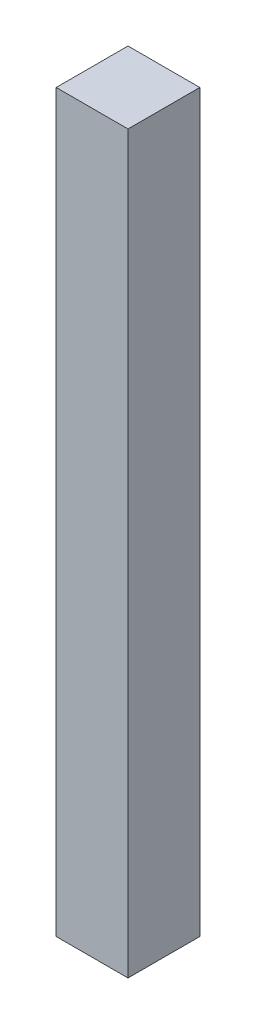
ISO-10303-21;
HEADER;
FILE_DESCRIPTION(('STEP AP214'),'2;1');
FILE_NAME('part.step','',(''),(''),'','','');
FILE_SCHEMA(('AUTOMOTIVE_DESIGN { 1 0 10303 214 1 1 1 1 }'));
ENDSEC;
DATA;
#1=APPLICATION_CONTEXT('core data for automotive mechanical design processes');
#2=APPLICATION_PROTOCOL_DEFINITION('international standard','automotive_design',2000,#1);
#3=PRODUCT_CONTEXT('',#1,'mechanical');
#4=PRODUCT('Part','Part','',(#3));
#5=PRODUCT_RELATED_PRODUCT_CATEGORY('part','',(#4));
#6=PRODUCT_DEFINITION_FORMATION('','',#4);
#7=PRODUCT_DEFINITION_CONTEXT('part definition',#1,'design');
#8=PRODUCT_DEFINITION('design','',#6,#7);
#9=PRODUCT_DEFINITION_SHAPE('','',#8);
#10=(LENGTH_UNIT() NAMED_UNIT(*) SI_UNIT(.MILLI.,.METRE.));
#11=(NAMED_UNIT(*) PLANE_ANGLE_UNIT() SI_UNIT($,.RADIAN.));
#12=(NAMED_UNIT(*) SI_UNIT($,.STERADIAN.) SOLID_ANGLE_UNIT());
#13=UNCERTAINTY_MEASURE_WITH_UNIT(LENGTH_MEASURE(1.E-05),#10,'distance_accuracy_value','');
#14=(GEOMETRIC_REPRESENTATION_CONTEXT(3) GLOBAL_UNCERTAINTY_ASSIGNED_CONTEXT((#13)) GLOBAL_UNIT_ASSIGNED_CONTEXT((#10,
#11,#12)) REPRESENTATION_CONTEXT('',''));
#15=CARTESIAN_POINT('',(0.,0.,0.));
#16=DIRECTION('',(0.,0.,1.));
#17=DIRECTION('',(1.,0.,0.));
#18=AXIS2_PLACEMENT_3D('',#15,#16,#17);
#19=CARTESIAN_POINT('',(3.15,64.5,-3.15));
#20=DIRECTION('',(-1.,0.,0.));
#21=DIRECTION('',(0.,0.,1.));
#22=AXIS2_PLACEMENT_3D('',#19,#20,#21);
#23=PLANE('',#22);
#24=DIRECTION('',(0.,0.,-1.));
#25=VECTOR('',#24,1.);
#26=CARTESIAN_POINT('',(3.15,0.,-3.15));
#27=LINE('',#26,#25);
#28=CARTESIAN_POINT('',(3.15,0.,3.15));
#29=VERTEX_POINT('',#28);
#30=CARTESIAN_POINT('',(3.15,0.,-3.15));
#31=VERTEX_POINT('',#30);
#32=EDGE_CURVE('E95',#29,#31,#27,.T.);
#33=ORIENTED_EDGE('',*,*,#32,.T.);
#34=DIRECTION('',(0.,-1.,0.));
#35=VECTOR('',#34,1.);
#36=CARTESIAN_POINT('',(3.15,64.5,-3.15));
#37=LINE('',#36,#35);
#38=CARTESIAN_POINT('',(3.15,64.5,-3.15));
#39=VERTEX_POINT('',#38);
#40=EDGE_CURVE('E11',#39,#31,#37,.T.);
#41=ORIENTED_EDGE('',*,*,#40,.F.);
#42=DIRECTION('',(0.,0.,-1.));
#43=VECTOR('',#42,1.);
#44=CARTESIAN_POINT('',(3.15,64.5,-3.15));
#45=LINE('',#44,#43);
#46=CARTESIAN_POINT('',(3.15,64.5,3.15));
#47=VERTEX_POINT('',#46);
#48=EDGE_CURVE('E83',#47,#39,#45,.T.);
#49=ORIENTED_EDGE('',*,*,#48,.F.);
#50=DIRECTION('',(0.,-1.,0.));
#51=VECTOR('',#50,1.);
#52=CARTESIAN_POINT('',(3.15,64.5,3.15));
#53=LINE('',#52,#51);
#54=EDGE_CURVE('E91',#47,#29,#53,.T.);
#55=ORIENTED_EDGE('',*,*,#54,.T.);
#56=EDGE_LOOP('',(#33,#41,#49,#55));
#57=FACE_BOUND('',#56,.T.);
#58=ADVANCED_FACE('F32',(#57),#23,.F.);
#59=CARTESIAN_POINT('',(-3.15,64.5,-3.15));
#60=DIRECTION('',(0.,0.,1.));
#61=DIRECTION('',(1.,0.,0.));
#62=AXIS2_PLACEMENT_3D('',#59,#60,#61);
#63=PLANE('',#62);
#64=DIRECTION('',(-1.,0.,0.));
#65=VECTOR('',#64,1.);
#66=CARTESIAN_POINT('',(-3.15,0.,-3.15));
#67=LINE('',#66,#65);
#68=CARTESIAN_POINT('',(-3.15,0.,-3.15));
#69=VERTEX_POINT('',#68);
#70=EDGE_CURVE('E87',#31,#69,#67,.T.);
#71=ORIENTED_EDGE('',*,*,#70,.T.);
#72=DIRECTION('',(0.,-1.,0.));
#73=VECTOR('',#72,1.);
#74=CARTESIAN_POINT('',(-3.15,64.5,-3.15));
#75=LINE('',#74,#73);
#76=CARTESIAN_POINT('',(-3.15,64.5,-3.15));
#77=VERTEX_POINT('',#76);
#78=EDGE_CURVE('E40',#77,#69,#75,.T.);
#79=ORIENTED_EDGE('',*,*,#78,.F.);
#80=DIRECTION('',(-1.,0.,0.));
#81=VECTOR('',#80,1.);
#82=CARTESIAN_POINT('',(-3.15,64.5,-3.15));
#83=LINE('',#82,#81);
#84=EDGE_CURVE('E78',#39,#77,#83,.T.);
#85=ORIENTED_EDGE('',*,*,#84,.F.);
#86=ORIENTED_EDGE('',*,*,#40,.T.);
#87=EDGE_LOOP('',(#71,#79,#85,#86));
#88=FACE_BOUND('',#87,.T.);
#89=ADVANCED_FACE('F86',(#88),#63,.F.);
#90=CARTESIAN_POINT('',(-3.15,64.5,-3.15));
#91=DIRECTION('',(1.,0.,0.));
#92=DIRECTION('',(0.,0.,-1.));
#93=AXIS2_PLACEMENT_3D('',#90,#91,#92);
#94=PLANE('',#93);
#95=DIRECTION('',(0.,0.,1.));
#96=VECTOR('',#95,1.);
#97=CARTESIAN_POINT('',(-3.15,0.,-3.15));
#98=LINE('',#97,#96);
#99=CARTESIAN_POINT('',(-3.15,0.,3.15));
#100=VERTEX_POINT('',#99);
#101=EDGE_CURVE('E65',#69,#100,#98,.T.);
#102=ORIENTED_EDGE('',*,*,#101,.T.);
#103=DIRECTION('',(0.,-1.,0.));
#104=VECTOR('',#103,1.);
#105=CARTESIAN_POINT('',(-3.15,64.5,3.15));
#106=LINE('',#105,#104);
#107=CARTESIAN_POINT('',(-3.15,64.5,3.15));
#108=VERTEX_POINT('',#107);
#109=EDGE_CURVE('E88',#108,#100,#106,.T.);
#110=ORIENTED_EDGE('',*,*,#109,.F.);
#111=DIRECTION('',(0.,0.,1.));
#112=VECTOR('',#111,1.);
#113=CARTESIAN_POINT('',(-3.15,64.5,-3.15));
#114=LINE('',#113,#112);
#115=EDGE_CURVE('E81',#77,#108,#114,.T.);
#116=ORIENTED_EDGE('',*,*,#115,.F.);
#117=ORIENTED_EDGE('',*,*,#78,.T.);
#118=EDGE_LOOP('',(#102,#110,#116,#117));
#119=FACE_BOUND('',#118,.T.);
#120=ADVANCED_FACE('F89',(#119),#94,.F.);
#121=CARTESIAN_POINT('',(-3.15,64.5,3.15));
#122=DIRECTION('',(0.,0.,-1.));
#123=DIRECTION('',(-1.,0.,0.));
#124=AXIS2_PLACEMENT_3D('',#121,#122,#123);
#125=PLANE('',#124);
#126=DIRECTION('',(1.,0.,0.));
#127=VECTOR('',#126,1.);
#128=CARTESIAN_POINT('',(-3.15,0.,3.15));
#129=LINE('',#128,#127);
#130=EDGE_CURVE('E71',#100,#29,#129,.T.);
#131=ORIENTED_EDGE('',*,*,#130,.T.);
#132=ORIENTED_EDGE('',*,*,#54,.F.);
#133=DIRECTION('',(1.,0.,0.));
#134=VECTOR('',#133,1.);
#135=CARTESIAN_POINT('',(-3.15,64.5,3.15));
#136=LINE('',#135,#134);
#137=EDGE_CURVE('E48',#108,#47,#136,.T.);
#138=ORIENTED_EDGE('',*,*,#137,.F.);
#139=ORIENTED_EDGE('',*,*,#109,.T.);
#140=EDGE_LOOP('',(#131,#132,#138,#139));
#141=FACE_BOUND('',#140,.T.);
#142=ADVANCED_FACE('F102',(#141),#125,.F.);
#143=CARTESIAN_POINT('',(0.,64.5,0.));
#144=DIRECTION('',(0.,1.,0.));
#145=DIRECTION('',(0.,0.,1.));
#146=AXIS2_PLACEMENT_3D('',#143,#144,#145);
#147=PLANE('',#146);
#148=ORIENTED_EDGE('',*,*,#48,.T.);
#149=ORIENTED_EDGE('',*,*,#84,.T.);
#150=ORIENTED_EDGE('',*,*,#115,.T.);
#151=ORIENTED_EDGE('',*,*,#137,.T.);
#152=EDGE_LOOP('',(#148,#149,#150,#151));
#153=FACE_BOUND('',#152,.T.);
#154=ADVANCED_FACE('F79',(#153),#147,.T.);
#155=CARTESIAN_POINT('',(0.,0.,0.));
#156=DIRECTION('',(0.,1.,0.));
#157=DIRECTION('',(0.,0.,1.));
#158=AXIS2_PLACEMENT_3D('',#155,#156,#157);
#159=PLANE('',#158);
#160=ORIENTED_EDGE('',*,*,#32,.F.);
#161=ORIENTED_EDGE('',*,*,#130,.F.);
#162=ORIENTED_EDGE('',*,*,#101,.F.);
#163=ORIENTED_EDGE('',*,*,#70,.F.);
#164=EDGE_LOOP('',(#160,#161,#162,#163));
#165=FACE_BOUND('',#164,.T.);
#166=ADVANCED_FACE('F105',(#165),#159,.F.);
#167=CLOSED_SHELL('',(#58,#89,#120,#142,#154,#166));
#168=MANIFOLD_SOLID_BREP('B2',#167);
#169=ADVANCED_BREP_SHAPE_REPRESENTATION('',(#18,#168),#14);
#170=SHAPE_DEFINITION_REPRESENTATION(#9,#169);
ENDSEC;
END-ISO-10303-21;
